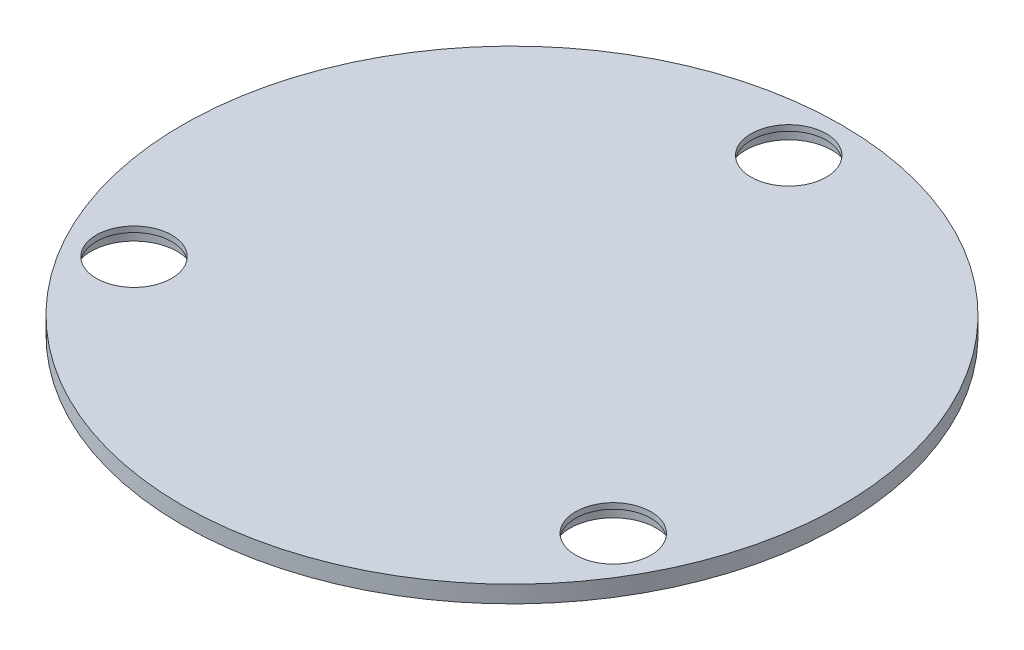
ISO-10303-21;
HEADER;
FILE_DESCRIPTION(('STEP AP214'),'2;1');
FILE_NAME('part.step','',(''),(''),'','','');
FILE_SCHEMA(('AUTOMOTIVE_DESIGN { 1 0 10303 214 1 1 1 1 }'));
ENDSEC;
DATA;
#1=APPLICATION_CONTEXT('core data for automotive mechanical design processes');
#2=APPLICATION_PROTOCOL_DEFINITION('international standard','automotive_design',2000,#1);
#3=PRODUCT_CONTEXT('',#1,'mechanical');
#4=PRODUCT('Part','Part','',(#3));
#5=PRODUCT_RELATED_PRODUCT_CATEGORY('part','',(#4));
#6=PRODUCT_DEFINITION_FORMATION('','',#4);
#7=PRODUCT_DEFINITION_CONTEXT('part definition',#1,'design');
#8=PRODUCT_DEFINITION('design','',#6,#7);
#9=PRODUCT_DEFINITION_SHAPE('','',#8);
#10=(LENGTH_UNIT() NAMED_UNIT(*) SI_UNIT(.MILLI.,.METRE.));
#11=(NAMED_UNIT(*) PLANE_ANGLE_UNIT() SI_UNIT($,.RADIAN.));
#12=(NAMED_UNIT(*) SI_UNIT($,.STERADIAN.) SOLID_ANGLE_UNIT());
#13=UNCERTAINTY_MEASURE_WITH_UNIT(LENGTH_MEASURE(1.E-05),#10,'distance_accuracy_value','');
#14=(GEOMETRIC_REPRESENTATION_CONTEXT(3) GLOBAL_UNCERTAINTY_ASSIGNED_CONTEXT((#13)) GLOBAL_UNIT_ASSIGNED_CONTEXT((#10,
#11,#12)) REPRESENTATION_CONTEXT('',''));
#15=CARTESIAN_POINT('',(0.,0.,0.));
#16=DIRECTION('',(0.,0.,1.));
#17=DIRECTION('',(1.,0.,0.));
#18=AXIS2_PLACEMENT_3D('',#15,#16,#17);
#19=CARTESIAN_POINT('',(0.,3.,-48.6994952061449));
#20=DIRECTION('',(0.,-1.,0.));
#21=DIRECTION('',(0.,0.,-1.));
#22=AXIS2_PLACEMENT_3D('',#19,#20,#21);
#23=CYLINDRICAL_SURFACE('',#22,6.625);
#24=CARTESIAN_POINT('',(0.,3.,-48.6994952061449));
#25=DIRECTION('',(0.,1.,0.));
#26=DIRECTION('',(0.,0.,1.));
#27=AXIS2_PLACEMENT_3D('',#24,#25,#26);
#28=CIRCLE('',#27,6.625);
#29=CARTESIAN_POINT('',(0.,3.,-42.0744952061449));
#30=VERTEX_POINT('',#29);
#31=EDGE_CURVE('E52',#30,#30,#28,.T.);
#32=ORIENTED_EDGE('',*,*,#31,.T.);
#33=EDGE_LOOP('',(#32));
#34=FACE_BOUND('',#33,.T.);
#35=CARTESIAN_POINT('',(0.,2.,-48.6994952061449));
#36=DIRECTION('',(0.,-1.,0.));
#37=DIRECTION('',(0.,0.,-1.));
#38=AXIS2_PLACEMENT_3D('',#35,#36,#37);
#39=CIRCLE('',#38,6.625);
#40=CARTESIAN_POINT('',(0.,2.,-55.3244952061449));
#41=VERTEX_POINT('',#40);
#42=EDGE_CURVE('E41',#41,#41,#39,.T.);
#43=ORIENTED_EDGE('',*,*,#42,.T.);
#44=EDGE_LOOP('',(#43));
#45=FACE_BOUND('',#44,.T.);
#46=ADVANCED_FACE('F37',(#34,#45),#23,.F.);
#47=CARTESIAN_POINT('',(42.175,3.,24.3497476030725));
#48=DIRECTION('',(0.,-1.,0.));
#49=DIRECTION('',(0.,0.,-1.));
#50=AXIS2_PLACEMENT_3D('',#47,#48,#49);
#51=CYLINDRICAL_SURFACE('',#50,6.625);
#52=CARTESIAN_POINT('',(42.175,3.,24.3497476030725));
#53=DIRECTION('',(0.,1.,0.));
#54=DIRECTION('',(0.,0.,1.));
#55=AXIS2_PLACEMENT_3D('',#52,#53,#54);
#56=CIRCLE('',#55,6.625);
#57=CARTESIAN_POINT('',(42.175,3.,30.9747476030725));
#58=VERTEX_POINT('',#57);
#59=EDGE_CURVE('E73',#58,#58,#56,.T.);
#60=ORIENTED_EDGE('',*,*,#59,.T.);
#61=EDGE_LOOP('',(#60));
#62=FACE_BOUND('',#61,.T.);
#63=CARTESIAN_POINT('',(42.175,2.,24.3497476030725));
#64=DIRECTION('',(0.,-1.,0.));
#65=DIRECTION('',(0.,0.,-1.));
#66=AXIS2_PLACEMENT_3D('',#63,#64,#65);
#67=CIRCLE('',#66,6.625);
#68=CARTESIAN_POINT('',(42.175,2.,17.7247476030725));
#69=VERTEX_POINT('',#68);
#70=EDGE_CURVE('E60',#69,#69,#67,.T.);
#71=ORIENTED_EDGE('',*,*,#70,.T.);
#72=EDGE_LOOP('',(#71));
#73=FACE_BOUND('',#72,.T.);
#74=ADVANCED_FACE('F127',(#62,#73),#51,.F.);
#75=CARTESIAN_POINT('',(-42.175,3.,24.3497476030725));
#76=DIRECTION('',(0.,-1.,0.));
#77=DIRECTION('',(0.,0.,-1.));
#78=AXIS2_PLACEMENT_3D('',#75,#76,#77);
#79=CYLINDRICAL_SURFACE('',#78,6.62500000000001);
#80=CARTESIAN_POINT('',(-42.175,3.,24.3497476030725));
#81=DIRECTION('',(0.,1.,0.));
#82=DIRECTION('',(0.,0.,1.));
#83=AXIS2_PLACEMENT_3D('',#80,#81,#82);
#84=CIRCLE('',#83,6.62500000000001);
#85=CARTESIAN_POINT('',(-42.175,3.,30.9747476030725));
#86=VERTEX_POINT('',#85);
#87=EDGE_CURVE('E68',#86,#86,#84,.T.);
#88=ORIENTED_EDGE('',*,*,#87,.T.);
#89=EDGE_LOOP('',(#88));
#90=FACE_BOUND('',#89,.T.);
#91=CARTESIAN_POINT('',(-42.175,2.,24.3497476030725));
#92=DIRECTION('',(0.,-1.,0.));
#93=DIRECTION('',(0.,0.,-1.));
#94=AXIS2_PLACEMENT_3D('',#91,#92,#93);
#95=CIRCLE('',#94,6.62500000000001);
#96=CARTESIAN_POINT('',(-42.175,2.,17.7247476030725));
#97=VERTEX_POINT('',#96);
#98=EDGE_CURVE('E57',#97,#97,#95,.T.);
#99=ORIENTED_EDGE('',*,*,#98,.T.);
#100=EDGE_LOOP('',(#99));
#101=FACE_BOUND('',#100,.T.);
#102=ADVANCED_FACE('F133',(#90,#101),#79,.F.);
#103=CARTESIAN_POINT('',(0.,3.,0.));
#104=DIRECTION('',(0.,1.,0.));
#105=DIRECTION('',(0.,0.,1.));
#106=AXIS2_PLACEMENT_3D('',#103,#104,#105);
#107=PLANE('',#106);
#108=ORIENTED_EDGE('',*,*,#59,.F.);
#109=EDGE_LOOP('',(#108));
#110=FACE_BOUND('',#109,.T.);
#111=CARTESIAN_POINT('',(0.,3.,0.));
#112=DIRECTION('',(0.,1.,0.));
#113=DIRECTION('',(0.,0.,1.));
#114=AXIS2_PLACEMENT_3D('',#111,#112,#113);
#115=CIRCLE('',#114,58.);
#116=CARTESIAN_POINT('',(0.,3.,58.));
#117=VERTEX_POINT('',#116);
#118=EDGE_CURVE('E10',#117,#117,#115,.T.);
#119=ORIENTED_EDGE('',*,*,#118,.T.);
#120=EDGE_LOOP('',(#119));
#121=FACE_BOUND('',#120,.T.);
#122=ORIENTED_EDGE('',*,*,#31,.F.);
#123=EDGE_LOOP('',(#122));
#124=FACE_BOUND('',#123,.T.);
#125=ORIENTED_EDGE('',*,*,#87,.F.);
#126=EDGE_LOOP('',(#125));
#127=FACE_BOUND('',#126,.T.);
#128=ADVANCED_FACE('F115',(#110,#121,#124,#127),#107,.T.);
#129=CARTESIAN_POINT('',(0.,0.,0.));
#130=DIRECTION('',(0.,1.,0.));
#131=DIRECTION('',(0.,0.,1.));
#132=AXIS2_PLACEMENT_3D('',#129,#130,#131);
#133=PLANE('',#132);
#134=CARTESIAN_POINT('',(-42.175,0.,24.3497476030725));
#135=DIRECTION('',(0.,-1.,0.));
#136=DIRECTION('',(0.,0.,-1.));
#137=AXIS2_PLACEMENT_3D('',#134,#135,#136);
#138=CIRCLE('',#137,7.6);
#139=CARTESIAN_POINT('',(-42.175,0.,16.7497476030725));
#140=VERTEX_POINT('',#139);
#141=EDGE_CURVE('E96',#140,#140,#138,.T.);
#142=ORIENTED_EDGE('',*,*,#141,.F.);
#143=EDGE_LOOP('',(#142));
#144=FACE_BOUND('',#143,.T.);
#145=CARTESIAN_POINT('',(0.,0.,-48.6994952061449));
#146=DIRECTION('',(0.,-1.,0.));
#147=DIRECTION('',(0.,0.,-1.));
#148=AXIS2_PLACEMENT_3D('',#145,#146,#147);
#149=CIRCLE('',#148,7.6);
#150=CARTESIAN_POINT('',(0.,0.,-56.2994952061449));
#151=VERTEX_POINT('',#150);
#152=EDGE_CURVE('E88',#151,#151,#149,.T.);
#153=ORIENTED_EDGE('',*,*,#152,.F.);
#154=EDGE_LOOP('',(#153));
#155=FACE_BOUND('',#154,.T.);
#156=CARTESIAN_POINT('',(42.175,0.,24.3497476030725));
#157=DIRECTION('',(0.,-1.,0.));
#158=DIRECTION('',(0.,0.,-1.));
#159=AXIS2_PLACEMENT_3D('',#156,#157,#158);
#160=CIRCLE('',#159,7.6);
#161=CARTESIAN_POINT('',(42.175,0.,16.7497476030725));
#162=VERTEX_POINT('',#161);
#163=EDGE_CURVE('E80',#162,#162,#160,.T.);
#164=ORIENTED_EDGE('',*,*,#163,.F.);
#165=EDGE_LOOP('',(#164));
#166=FACE_BOUND('',#165,.T.);
#167=CARTESIAN_POINT('',(0.,0.,0.));
#168=DIRECTION('',(0.,1.,0.));
#169=DIRECTION('',(0.,0.,1.));
#170=AXIS2_PLACEMENT_3D('',#167,#168,#169);
#171=CIRCLE('',#170,58.);
#172=CARTESIAN_POINT('',(0.,0.,58.));
#173=VERTEX_POINT('',#172);
#174=EDGE_CURVE('E46',#173,#173,#171,.T.);
#175=ORIENTED_EDGE('',*,*,#174,.F.);
#176=EDGE_LOOP('',(#175));
#177=FACE_BOUND('',#176,.T.);
#178=ADVANCED_FACE('F112',(#144,#155,#166,#177),#133,.F.);
#179=CARTESIAN_POINT('',(0.,3.,0.));
#180=DIRECTION('',(0.,-1.,0.));
#181=DIRECTION('',(0.,0.,-1.));
#182=AXIS2_PLACEMENT_3D('',#179,#180,#181);
#183=CYLINDRICAL_SURFACE('',#182,58.);
#184=ORIENTED_EDGE('',*,*,#118,.F.);
#185=EDGE_LOOP('',(#184));
#186=FACE_BOUND('',#185,.T.);
#187=ORIENTED_EDGE('',*,*,#174,.T.);
#188=EDGE_LOOP('',(#187));
#189=FACE_BOUND('',#188,.T.);
#190=ADVANCED_FACE('F39',(#186,#189),#183,.T.);
#191=CARTESIAN_POINT('',(-42.175,2.,24.3497476030725));
#192=DIRECTION('',(0.,-1.,0.));
#193=DIRECTION('',(0.,0.,-1.));
#194=AXIS2_PLACEMENT_3D('',#191,#192,#193);
#195=CYLINDRICAL_SURFACE('',#194,7.6);
#196=CARTESIAN_POINT('',(-42.175,2.,24.3497476030725));
#197=DIRECTION('',(0.,-1.,0.));
#198=DIRECTION('',(0.,0.,-1.));
#199=AXIS2_PLACEMENT_3D('',#196,#197,#198);
#200=CIRCLE('',#199,7.6);
#201=CARTESIAN_POINT('',(-42.175,2.,16.7497476030725));
#202=VERTEX_POINT('',#201);
#203=EDGE_CURVE('E61',#202,#202,#200,.T.);
#204=ORIENTED_EDGE('',*,*,#203,.F.);
#205=EDGE_LOOP('',(#204));
#206=FACE_BOUND('',#205,.T.);
#207=ORIENTED_EDGE('',*,*,#141,.T.);
#208=EDGE_LOOP('',(#207));
#209=FACE_BOUND('',#208,.T.);
#210=ADVANCED_FACE('F106',(#206,#209),#195,.F.);
#211=CARTESIAN_POINT('',(-42.175,2.,24.3497476030725));
#212=DIRECTION('',(0.,-1.,0.));
#213=DIRECTION('',(0.,0.,-1.));
#214=AXIS2_PLACEMENT_3D('',#211,#212,#213);
#215=PLANE('',#214);
#216=ORIENTED_EDGE('',*,*,#98,.F.);
#217=EDGE_LOOP('',(#216));
#218=FACE_BOUND('',#217,.T.);
#219=ORIENTED_EDGE('',*,*,#203,.T.);
#220=EDGE_LOOP('',(#219));
#221=FACE_BOUND('',#220,.T.);
#222=ADVANCED_FACE('F104',(#218,#221),#215,.T.);
#223=CARTESIAN_POINT('',(42.175,2.,24.3497476030725));
#224=DIRECTION('',(0.,-1.,0.));
#225=DIRECTION('',(0.,0.,-1.));
#226=AXIS2_PLACEMENT_3D('',#223,#224,#225);
#227=CYLINDRICAL_SURFACE('',#226,7.6);
#228=CARTESIAN_POINT('',(42.175,2.,24.3497476030725));
#229=DIRECTION('',(0.,-1.,0.));
#230=DIRECTION('',(0.,0.,-1.));
#231=AXIS2_PLACEMENT_3D('',#228,#229,#230);
#232=CIRCLE('',#231,7.6);
#233=CARTESIAN_POINT('',(42.175,2.,16.7497476030725));
#234=VERTEX_POINT('',#233);
#235=EDGE_CURVE('E84',#234,#234,#232,.T.);
#236=ORIENTED_EDGE('',*,*,#235,.F.);
#237=EDGE_LOOP('',(#236));
#238=FACE_BOUND('',#237,.T.);
#239=ORIENTED_EDGE('',*,*,#163,.T.);
#240=EDGE_LOOP('',(#239));
#241=FACE_BOUND('',#240,.T.);
#242=ADVANCED_FACE('F153',(#238,#241),#227,.F.);
#243=CARTESIAN_POINT('',(42.175,2.,24.3497476030725));
#244=DIRECTION('',(0.,-1.,0.));
#245=DIRECTION('',(0.,0.,-1.));
#246=AXIS2_PLACEMENT_3D('',#243,#244,#245);
#247=PLANE('',#246);
#248=ORIENTED_EDGE('',*,*,#70,.F.);
#249=EDGE_LOOP('',(#248));
#250=FACE_BOUND('',#249,.T.);
#251=ORIENTED_EDGE('',*,*,#235,.T.);
#252=EDGE_LOOP('',(#251));
#253=FACE_BOUND('',#252,.T.);
#254=ADVANCED_FACE('F156',(#250,#253),#247,.T.);
#255=CARTESIAN_POINT('',(0.,2.,-48.6994952061449));
#256=DIRECTION('',(0.,-1.,0.));
#257=DIRECTION('',(0.,0.,-1.));
#258=AXIS2_PLACEMENT_3D('',#255,#256,#257);
#259=CYLINDRICAL_SURFACE('',#258,7.6);
#260=CARTESIAN_POINT('',(0.,2.,-48.6994952061449));
#261=DIRECTION('',(0.,-1.,0.));
#262=DIRECTION('',(0.,0.,-1.));
#263=AXIS2_PLACEMENT_3D('',#260,#261,#262);
#264=CIRCLE('',#263,7.6);
#265=CARTESIAN_POINT('',(0.,2.,-56.2994952061449));
#266=VERTEX_POINT('',#265);
#267=EDGE_CURVE('E92',#266,#266,#264,.T.);
#268=ORIENTED_EDGE('',*,*,#267,.F.);
#269=EDGE_LOOP('',(#268));
#270=FACE_BOUND('',#269,.T.);
#271=ORIENTED_EDGE('',*,*,#152,.T.);
#272=EDGE_LOOP('',(#271));
#273=FACE_BOUND('',#272,.T.);
#274=ADVANCED_FACE('F160',(#270,#273),#259,.F.);
#275=CARTESIAN_POINT('',(0.,2.,-48.6994952061449));
#276=DIRECTION('',(0.,-1.,0.));
#277=DIRECTION('',(0.,0.,-1.));
#278=AXIS2_PLACEMENT_3D('',#275,#276,#277);
#279=PLANE('',#278);
#280=ORIENTED_EDGE('',*,*,#42,.F.);
#281=EDGE_LOOP('',(#280));
#282=FACE_BOUND('',#281,.T.);
#283=ORIENTED_EDGE('',*,*,#267,.T.);
#284=EDGE_LOOP('',(#283));
#285=FACE_BOUND('',#284,.T.);
#286=ADVANCED_FACE('F164',(#282,#285),#279,.T.);
#287=CLOSED_SHELL('',(#46,#74,#102,#128,#178,#190,#210,#222,#242,#254,#274,#286));
#288=MANIFOLD_SOLID_BREP('B2',#287);
#289=ADVANCED_BREP_SHAPE_REPRESENTATION('',(#18,#288),#14);
#290=SHAPE_DEFINITION_REPRESENTATION(#9,#289);
ENDSEC;
END-ISO-10303-21;
